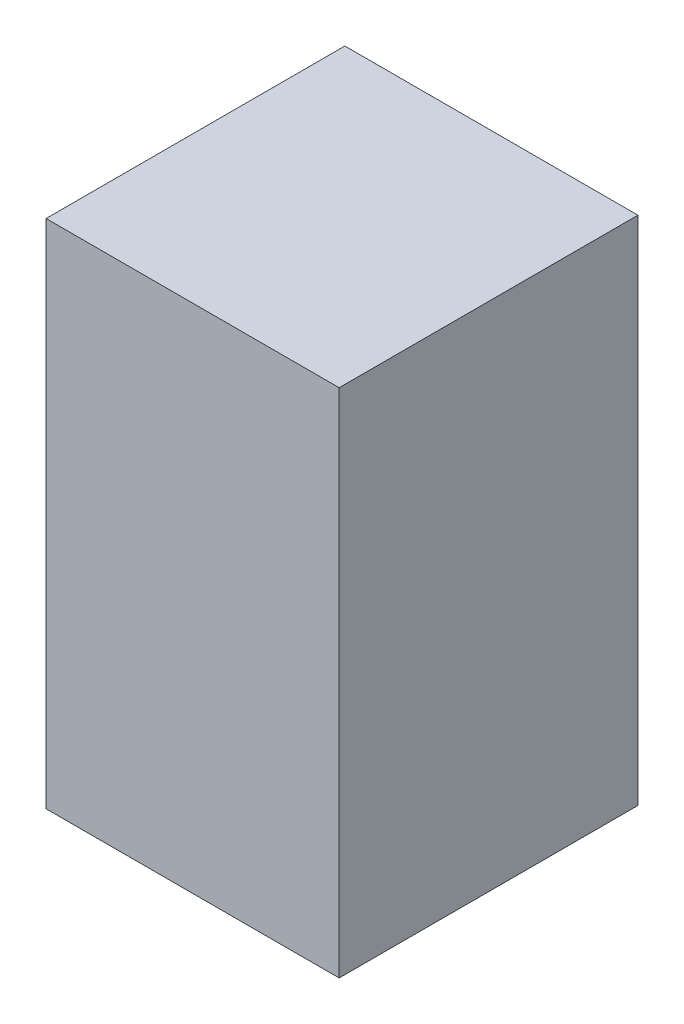
ISO-10303-21;
HEADER;
FILE_DESCRIPTION(('STEP AP214'),'2;1');
FILE_NAME('part.step','',(''),(''),'','','');
FILE_SCHEMA(('AUTOMOTIVE_DESIGN { 1 0 10303 214 1 1 1 1 }'));
ENDSEC;
DATA;
#1=APPLICATION_CONTEXT('core data for automotive mechanical design processes');
#2=APPLICATION_PROTOCOL_DEFINITION('international standard','automotive_design',2000,#1);
#3=PRODUCT_CONTEXT('',#1,'mechanical');
#4=PRODUCT('Part','Part','',(#3));
#5=PRODUCT_RELATED_PRODUCT_CATEGORY('part','',(#4));
#6=PRODUCT_DEFINITION_FORMATION('','',#4);
#7=PRODUCT_DEFINITION_CONTEXT('part definition',#1,'design');
#8=PRODUCT_DEFINITION('design','',#6,#7);
#9=PRODUCT_DEFINITION_SHAPE('','',#8);
#10=(LENGTH_UNIT() NAMED_UNIT(*) SI_UNIT(.MILLI.,.METRE.));
#11=(NAMED_UNIT(*) PLANE_ANGLE_UNIT() SI_UNIT($,.RADIAN.));
#12=(NAMED_UNIT(*) SI_UNIT($,.STERADIAN.) SOLID_ANGLE_UNIT());
#13=UNCERTAINTY_MEASURE_WITH_UNIT(LENGTH_MEASURE(1.E-05),#10,'distance_accuracy_value','');
#14=(GEOMETRIC_REPRESENTATION_CONTEXT(3) GLOBAL_UNCERTAINTY_ASSIGNED_CONTEXT((#13)) GLOBAL_UNIT_ASSIGNED_CONTEXT((#10,
#11,#12)) REPRESENTATION_CONTEXT('',''));
#15=CARTESIAN_POINT('',(0.,0.,0.));
#16=DIRECTION('',(0.,0.,1.));
#17=DIRECTION('',(1.,0.,0.));
#18=AXIS2_PLACEMENT_3D('',#15,#16,#17);
#19=CARTESIAN_POINT('',(0.,20.3219999701977,0.));
#20=DIRECTION('',(0.,1.,0.));
#21=DIRECTION('',(1.,0.,0.));
#22=AXIS2_PLACEMENT_3D('',#19,#20,#21);
#23=PLANE('',#22);
#24=DIRECTION('',(0.,0.,-1.));
#25=VECTOR('',#24,1.);
#26=CARTESIAN_POINT('',(37.29,20.3219999701977,51.25));
#27=LINE('',#26,#25);
#28=CARTESIAN_POINT('',(37.29,20.3219999701977,51.25));
#29=VERTEX_POINT('',#28);
#30=CARTESIAN_POINT('',(37.29,20.3219999701977,40.25));
#31=VERTEX_POINT('',#30);
#32=EDGE_CURVE('E11',#29,#31,#27,.T.);
#33=ORIENTED_EDGE('',*,*,#32,.T.);
#34=DIRECTION('',(-1.,0.,0.));
#35=VECTOR('',#34,1.);
#36=CARTESIAN_POINT('',(37.29,20.3219999701977,40.25));
#37=LINE('',#36,#35);
#38=CARTESIAN_POINT('',(26.5,20.3219999701977,40.25));
#39=VERTEX_POINT('',#38);
#40=EDGE_CURVE('E70',#31,#39,#37,.T.);
#41=ORIENTED_EDGE('',*,*,#40,.T.);
#42=DIRECTION('',(0.,0.,1.));
#43=VECTOR('',#42,1.);
#44=CARTESIAN_POINT('',(26.5,20.3219999701977,40.25));
#45=LINE('',#44,#43);
#46=CARTESIAN_POINT('',(26.5,20.3219999701977,51.25));
#47=VERTEX_POINT('',#46);
#48=EDGE_CURVE('E64',#39,#47,#45,.T.);
#49=ORIENTED_EDGE('',*,*,#48,.T.);
#50=DIRECTION('',(1.,0.,0.));
#51=VECTOR('',#50,1.);
#52=CARTESIAN_POINT('',(26.5,20.3219999701977,51.25));
#53=LINE('',#52,#51);
#54=EDGE_CURVE('E67',#47,#29,#53,.T.);
#55=ORIENTED_EDGE('',*,*,#54,.T.);
#56=EDGE_LOOP('',(#33,#41,#49,#55));
#57=FACE_BOUND('',#56,.T.);
#58=ADVANCED_FACE('F16',(#57),#23,.T.);
#59=CARTESIAN_POINT('',(37.29,1.5,51.25));
#60=DIRECTION('',(1.,0.,0.));
#61=DIRECTION('',(0.,1.,0.));
#62=AXIS2_PLACEMENT_3D('',#59,#60,#61);
#63=PLANE('',#62);
#64=DIRECTION('',(0.,0.,1.));
#65=VECTOR('',#64,1.);
#66=CARTESIAN_POINT('',(37.29,1.5,25.625));
#67=LINE('',#66,#65);
#68=CARTESIAN_POINT('',(37.29,1.5,40.25));
#69=VERTEX_POINT('',#68);
#70=CARTESIAN_POINT('',(37.29,1.5,51.25));
#71=VERTEX_POINT('',#70);
#72=EDGE_CURVE('E99',#69,#71,#67,.T.);
#73=ORIENTED_EDGE('',*,*,#72,.F.);
#74=DIRECTION('',(0.,1.,0.));
#75=VECTOR('',#74,1.);
#76=CARTESIAN_POINT('',(37.29,1.5,40.25));
#77=LINE('',#76,#75);
#78=EDGE_CURVE('E20',#69,#31,#77,.T.);
#79=ORIENTED_EDGE('',*,*,#78,.T.);
#80=ORIENTED_EDGE('',*,*,#32,.F.);
#81=DIRECTION('',(0.,1.,0.));
#82=VECTOR('',#81,1.);
#83=CARTESIAN_POINT('',(37.29,1.5,51.25));
#84=LINE('',#83,#82);
#85=EDGE_CURVE('E87',#71,#29,#84,.T.);
#86=ORIENTED_EDGE('',*,*,#85,.F.);
#87=EDGE_LOOP('',(#73,#79,#80,#86));
#88=FACE_BOUND('',#87,.T.);
#89=ADVANCED_FACE('F120',(#88),#63,.T.);
#90=CARTESIAN_POINT('',(37.29,1.5,40.25));
#91=DIRECTION('',(0.,0.,-1.));
#92=DIRECTION('',(0.,-1.,0.));
#93=AXIS2_PLACEMENT_3D('',#90,#91,#92);
#94=PLANE('',#93);
#95=DIRECTION('',(1.,0.,0.));
#96=VECTOR('',#95,1.);
#97=CARTESIAN_POINT('',(18.645,1.5,40.25));
#98=LINE('',#97,#96);
#99=CARTESIAN_POINT('',(26.5,1.5,40.25));
#100=VERTEX_POINT('',#99);
#101=EDGE_CURVE('E103',#100,#69,#98,.T.);
#102=ORIENTED_EDGE('',*,*,#101,.F.);
#103=DIRECTION('',(0.,1.,0.));
#104=VECTOR('',#103,1.);
#105=CARTESIAN_POINT('',(26.5,1.5,40.25));
#106=LINE('',#105,#104);
#107=EDGE_CURVE('E75',#100,#39,#106,.T.);
#108=ORIENTED_EDGE('',*,*,#107,.T.);
#109=ORIENTED_EDGE('',*,*,#40,.F.);
#110=ORIENTED_EDGE('',*,*,#78,.F.);
#111=EDGE_LOOP('',(#102,#108,#109,#110));
#112=FACE_BOUND('',#111,.T.);
#113=ADVANCED_FACE('F115',(#112),#94,.T.);
#114=CARTESIAN_POINT('',(26.5,1.5,40.25));
#115=DIRECTION('',(-1.,0.,0.));
#116=DIRECTION('',(0.,0.,1.));
#117=AXIS2_PLACEMENT_3D('',#114,#115,#116);
#118=PLANE('',#117);
#119=DIRECTION('',(0.,0.,-1.));
#120=VECTOR('',#119,1.);
#121=CARTESIAN_POINT('',(26.5,1.5,20.125));
#122=LINE('',#121,#120);
#123=CARTESIAN_POINT('',(26.5,1.5,51.25));
#124=VERTEX_POINT('',#123);
#125=EDGE_CURVE('E81',#124,#100,#122,.T.);
#126=ORIENTED_EDGE('',*,*,#125,.F.);
#127=DIRECTION('',(0.,1.,0.));
#128=VECTOR('',#127,1.);
#129=CARTESIAN_POINT('',(26.5,1.5,51.25));
#130=LINE('',#129,#128);
#131=EDGE_CURVE('E76',#124,#47,#130,.T.);
#132=ORIENTED_EDGE('',*,*,#131,.T.);
#133=ORIENTED_EDGE('',*,*,#48,.F.);
#134=ORIENTED_EDGE('',*,*,#107,.F.);
#135=EDGE_LOOP('',(#126,#132,#133,#134));
#136=FACE_BOUND('',#135,.T.);
#137=ADVANCED_FACE('F79',(#136),#118,.T.);
#138=CARTESIAN_POINT('',(26.5,1.5,51.25));
#139=DIRECTION('',(0.,0.,1.));
#140=DIRECTION('',(1.,0.,0.));
#141=AXIS2_PLACEMENT_3D('',#138,#139,#140);
#142=PLANE('',#141);
#143=DIRECTION('',(-1.,0.,0.));
#144=VECTOR('',#143,1.);
#145=CARTESIAN_POINT('',(13.25,1.5,51.25));
#146=LINE('',#145,#144);
#147=EDGE_CURVE('E98',#71,#124,#146,.T.);
#148=ORIENTED_EDGE('',*,*,#147,.F.);
#149=ORIENTED_EDGE('',*,*,#85,.T.);
#150=ORIENTED_EDGE('',*,*,#54,.F.);
#151=ORIENTED_EDGE('',*,*,#131,.F.);
#152=EDGE_LOOP('',(#148,#149,#150,#151));
#153=FACE_BOUND('',#152,.T.);
#154=ADVANCED_FACE('F86',(#153),#142,.T.);
#155=CARTESIAN_POINT('',(-0.14892918312297,1.49999995944139,0.));
#156=DIRECTION('',(0.,-1.,0.));
#157=DIRECTION('',(0.,0.,-1.));
#158=AXIS2_PLACEMENT_3D('',#155,#156,#157);
#159=PLANE('',#158);
#160=ORIENTED_EDGE('',*,*,#101,.T.);
#161=ORIENTED_EDGE('',*,*,#72,.T.);
#162=ORIENTED_EDGE('',*,*,#147,.T.);
#163=ORIENTED_EDGE('',*,*,#125,.T.);
#164=EDGE_LOOP('',(#160,#161,#162,#163));
#165=FACE_BOUND('',#164,.T.);
#166=ADVANCED_FACE('F18',(#165),#159,.T.);
#167=CLOSED_SHELL('',(#58,#89,#113,#137,#154,#166));
#168=MANIFOLD_SOLID_BREP('B1',#167);
#169=ADVANCED_BREP_SHAPE_REPRESENTATION('',(#18,#168),#14);
#170=SHAPE_DEFINITION_REPRESENTATION(#9,#169);
ENDSEC;
END-ISO-10303-21;
